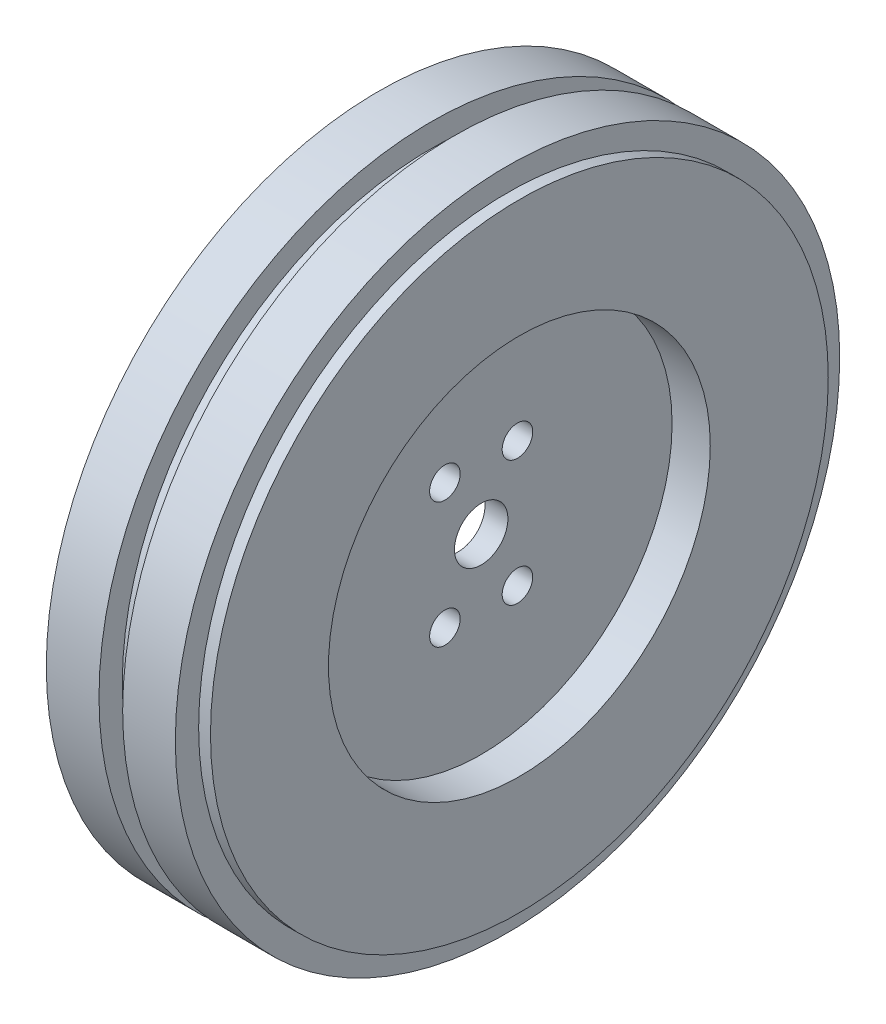
ISO-10303-21;
HEADER;
FILE_DESCRIPTION(('STEP AP214'),'2;1');
FILE_NAME('part.step','',(''),(''),'','','');
FILE_SCHEMA(('AUTOMOTIVE_DESIGN { 1 0 10303 214 1 1 1 1 }'));
ENDSEC;
DATA;
#1=APPLICATION_CONTEXT('core data for automotive mechanical design processes');
#2=APPLICATION_PROTOCOL_DEFINITION('international standard','automotive_design',2000,#1);
#3=PRODUCT_CONTEXT('',#1,'mechanical');
#4=PRODUCT('Part','Part','',(#3));
#5=PRODUCT_RELATED_PRODUCT_CATEGORY('part','',(#4));
#6=PRODUCT_DEFINITION_FORMATION('','',#4);
#7=PRODUCT_DEFINITION_CONTEXT('part definition',#1,'design');
#8=PRODUCT_DEFINITION('design','',#6,#7);
#9=PRODUCT_DEFINITION_SHAPE('','',#8);
#10=(LENGTH_UNIT() NAMED_UNIT(*) SI_UNIT(.MILLI.,.METRE.));
#11=(NAMED_UNIT(*) PLANE_ANGLE_UNIT() SI_UNIT($,.RADIAN.));
#12=(NAMED_UNIT(*) SI_UNIT($,.STERADIAN.) SOLID_ANGLE_UNIT());
#13=UNCERTAINTY_MEASURE_WITH_UNIT(LENGTH_MEASURE(1.E-05),#10,'distance_accuracy_value','');
#14=(GEOMETRIC_REPRESENTATION_CONTEXT(3) GLOBAL_UNCERTAINTY_ASSIGNED_CONTEXT((#13)) GLOBAL_UNIT_ASSIGNED_CONTEXT((#10,
#11,#12)) REPRESENTATION_CONTEXT('',''));
#15=CARTESIAN_POINT('',(0.,0.,0.));
#16=DIRECTION('',(0.,0.,1.));
#17=DIRECTION('',(1.,0.,0.));
#18=AXIS2_PLACEMENT_3D('',#15,#16,#17);
#19=CARTESIAN_POINT('',(8.00000000000001,0.,0.));
#20=DIRECTION('',(-1.,0.,0.));
#21=DIRECTION('',(0.,0.,1.));
#22=AXIS2_PLACEMENT_3D('',#19,#20,#21);
#23=CYLINDRICAL_SURFACE('',#22,43.5);
#24=CARTESIAN_POINT('',(-0.449999999999995,0.,0.));
#25=DIRECTION('',(-1.,0.,0.));
#26=DIRECTION('',(0.,0.,1.));
#27=AXIS2_PLACEMENT_3D('',#24,#25,#26);
#28=CIRCLE('',#27,43.5);
#29=CARTESIAN_POINT('',(-0.449999999999995,0.,43.5));
#30=VERTEX_POINT('',#29);
#31=EDGE_CURVE('E95',#30,#30,#28,.T.);
#32=ORIENTED_EDGE('',*,*,#31,.F.);
#33=EDGE_LOOP('',(#32));
#34=FACE_BOUND('',#33,.T.);
#35=CARTESIAN_POINT('',(6.45,0.,0.));
#36=DIRECTION('',(1.,0.,0.));
#37=DIRECTION('',(0.,0.,-1.));
#38=AXIS2_PLACEMENT_3D('',#35,#36,#37);
#39=CIRCLE('',#38,43.5);
#40=CARTESIAN_POINT('',(6.45,0.,-43.5));
#41=VERTEX_POINT('',#40);
#42=EDGE_CURVE('E101',#41,#41,#39,.T.);
#43=ORIENTED_EDGE('',*,*,#42,.F.);
#44=EDGE_LOOP('',(#43));
#45=FACE_BOUND('',#44,.T.);
#46=ADVANCED_FACE('F30',(#34,#45),#23,.T.);
#47=CARTESIAN_POINT('',(8.,40.,0.));
#48=DIRECTION('',(-1.,0.,0.));
#49=DIRECTION('',(0.,0.,1.));
#50=AXIS2_PLACEMENT_3D('',#47,#48,#49);
#51=PLANE('',#50);
#52=CARTESIAN_POINT('',(8.,0.,0.));
#53=DIRECTION('',(1.,0.,0.));
#54=DIRECTION('',(0.,0.,-1.));
#55=AXIS2_PLACEMENT_3D('',#52,#53,#54);
#56=CIRCLE('',#55,25.);
#57=CARTESIAN_POINT('',(8.,0.,-25.));
#58=VERTEX_POINT('',#57);
#59=EDGE_CURVE('E75',#58,#58,#56,.T.);
#60=ORIENTED_EDGE('',*,*,#59,.F.);
#61=EDGE_LOOP('',(#60));
#62=FACE_BOUND('',#61,.T.);
#63=CARTESIAN_POINT('',(8.,0.,0.));
#64=DIRECTION('',(1.,0.,0.));
#65=DIRECTION('',(0.,0.,-1.));
#66=AXIS2_PLACEMENT_3D('',#63,#64,#65);
#67=CIRCLE('',#66,40.45);
#68=CARTESIAN_POINT('',(8.,0.,-40.45));
#69=VERTEX_POINT('',#68);
#70=EDGE_CURVE('E105',#69,#69,#67,.T.);
#71=ORIENTED_EDGE('',*,*,#70,.T.);
#72=EDGE_LOOP('',(#71));
#73=FACE_BOUND('',#72,.T.);
#74=ADVANCED_FACE('F122',(#62,#73),#51,.F.);
#75=CARTESIAN_POINT('',(-12.,0.,0.));
#76=DIRECTION('',(-1.,0.,0.));
#77=DIRECTION('',(0.,0.,1.));
#78=AXIS2_PLACEMENT_3D('',#75,#76,#77);
#79=PLANE('',#78);
#80=CARTESIAN_POINT('',(-12.,0.,0.));
#81=DIRECTION('',(-1.,0.,0.));
#82=DIRECTION('',(0.,0.,1.));
#83=AXIS2_PLACEMENT_3D('',#80,#81,#82);
#84=CIRCLE('',#83,34.);
#85=CARTESIAN_POINT('',(-12.,0.,34.));
#86=VERTEX_POINT('',#85);
#87=EDGE_CURVE('E71',#86,#86,#84,.F.);
#88=ORIENTED_EDGE('',*,*,#87,.T.);
#89=EDGE_LOOP('',(#88));
#90=FACE_BOUND('',#89,.T.);
#91=CARTESIAN_POINT('',(-12.,0.,0.));
#92=DIRECTION('',(-1.,0.,0.));
#93=DIRECTION('',(0.,0.,1.));
#94=AXIS2_PLACEMENT_3D('',#91,#92,#93);
#95=CIRCLE('',#94,40.45);
#96=CARTESIAN_POINT('',(-12.,0.,40.45));
#97=VERTEX_POINT('',#96);
#98=EDGE_CURVE('E84',#97,#97,#95,.T.);
#99=ORIENTED_EDGE('',*,*,#98,.T.);
#100=EDGE_LOOP('',(#99));
#101=FACE_BOUND('',#100,.T.);
#102=ADVANCED_FACE('F129',(#90,#101),#79,.T.);
#103=CARTESIAN_POINT('',(-3.54999999999999,0.,0.));
#104=DIRECTION('',(-1.,0.,0.));
#105=DIRECTION('',(0.,0.,1.));
#106=AXIS2_PLACEMENT_3D('',#103,#104,#105);
#107=CIRCLE('',#106,43.5);
#108=CARTESIAN_POINT('',(-3.54999999999999,0.,43.5));
#109=VERTEX_POINT('',#108);
#110=EDGE_CURVE('E87',#109,#109,#107,.T.);
#111=ORIENTED_EDGE('',*,*,#110,.T.);
#112=EDGE_LOOP('',(#111));
#113=FACE_BOUND('',#112,.T.);
#114=CARTESIAN_POINT('',(-10.45,0.,0.));
#115=DIRECTION('',(-1.,0.,0.));
#116=DIRECTION('',(0.,0.,1.));
#117=AXIS2_PLACEMENT_3D('',#114,#115,#116);
#118=CIRCLE('',#117,43.5);
#119=CARTESIAN_POINT('',(-10.45,0.,43.5));
#120=VERTEX_POINT('',#119);
#121=EDGE_CURVE('E78',#120,#120,#118,.T.);
#122=ORIENTED_EDGE('',*,*,#121,.F.);
#123=EDGE_LOOP('',(#122));
#124=FACE_BOUND('',#123,.T.);
#125=ADVANCED_FACE('F125',(#113,#124),#23,.T.);
#126=CARTESIAN_POINT('',(-49.6444990272902,0.,0.));
#127=DIRECTION('',(-1.,0.,0.));
#128=DIRECTION('',(0.,0.,1.));
#129=AXIS2_PLACEMENT_3D('',#126,#127,#128);
#130=CYLINDRICAL_SURFACE('',#129,34.);
#131=CARTESIAN_POINT('',(0.,0.,0.));
#132=DIRECTION('',(-1.,0.,0.));
#133=DIRECTION('',(0.,0.,1.));
#134=AXIS2_PLACEMENT_3D('',#131,#132,#133);
#135=CIRCLE('',#134,34.);
#136=CARTESIAN_POINT('',(0.,0.,34.));
#137=VERTEX_POINT('',#136);
#138=EDGE_CURVE('E10',#137,#137,#135,.T.);
#139=ORIENTED_EDGE('',*,*,#138,.F.);
#140=EDGE_LOOP('',(#139));
#141=FACE_BOUND('',#140,.T.);
#142=ORIENTED_EDGE('',*,*,#87,.F.);
#143=EDGE_LOOP('',(#142));
#144=FACE_BOUND('',#143,.T.);
#145=ADVANCED_FACE('F32',(#141,#144),#130,.F.);
#146=CARTESIAN_POINT('',(0.,34.,0.));
#147=DIRECTION('',(1.,0.,0.));
#148=DIRECTION('',(0.,0.,-1.));
#149=AXIS2_PLACEMENT_3D('',#146,#147,#148);
#150=PLANE('',#149);
#151=CARTESIAN_POINT('',(0.,0.,0.));
#152=DIRECTION('',(1.,0.,0.));
#153=DIRECTION('',(0.,0.,-1.));
#154=AXIS2_PLACEMENT_3D('',#151,#152,#153);
#155=CIRCLE('',#154,3.5);
#156=CARTESIAN_POINT('',(0.,0.,-3.5));
#157=VERTEX_POINT('',#156);
#158=EDGE_CURVE('E65',#157,#157,#155,.T.);
#159=ORIENTED_EDGE('',*,*,#158,.T.);
#160=EDGE_LOOP('',(#159));
#161=FACE_BOUND('',#160,.T.);
#162=CARTESIAN_POINT('',(0.,8.22724133595216,4.75000000000001));
#163=DIRECTION('',(1.,0.,0.));
#164=DIRECTION('',(0.,0.,-1.));
#165=AXIS2_PLACEMENT_3D('',#162,#163,#164);
#166=CIRCLE('',#165,2.);
#167=CARTESIAN_POINT('',(0.,8.22724133595216,2.75000000000001));
#168=VERTEX_POINT('',#167);
#169=EDGE_CURVE('E37',#168,#168,#166,.T.);
#170=ORIENTED_EDGE('',*,*,#169,.T.);
#171=EDGE_LOOP('',(#170));
#172=FACE_BOUND('',#171,.T.);
#173=CARTESIAN_POINT('',(0.,-8.22724133595216,-4.75000000000001));
#174=DIRECTION('',(1.,0.,0.));
#175=DIRECTION('',(0.,0.,-1.));
#176=AXIS2_PLACEMENT_3D('',#173,#174,#175);
#177=CIRCLE('',#176,2.);
#178=CARTESIAN_POINT('',(0.,-8.22724133595216,-6.75000000000001));
#179=VERTEX_POINT('',#178);
#180=EDGE_CURVE('E41',#179,#179,#177,.T.);
#181=ORIENTED_EDGE('',*,*,#180,.T.);
#182=EDGE_LOOP('',(#181));
#183=FACE_BOUND('',#182,.T.);
#184=CARTESIAN_POINT('',(0.,-8.22724133595216,4.75000000000001));
#185=DIRECTION('',(1.,0.,0.));
#186=DIRECTION('',(0.,0.,-1.));
#187=AXIS2_PLACEMENT_3D('',#184,#185,#186);
#188=CIRCLE('',#187,2.);
#189=CARTESIAN_POINT('',(0.,-8.22724133595216,2.75000000000001));
#190=VERTEX_POINT('',#189);
#191=EDGE_CURVE('E45',#190,#190,#188,.T.);
#192=ORIENTED_EDGE('',*,*,#191,.T.);
#193=EDGE_LOOP('',(#192));
#194=FACE_BOUND('',#193,.T.);
#195=CARTESIAN_POINT('',(0.,8.22724133595216,-4.75000000000001));
#196=DIRECTION('',(1.,0.,0.));
#197=DIRECTION('',(0.,0.,-1.));
#198=AXIS2_PLACEMENT_3D('',#195,#196,#197);
#199=CIRCLE('',#198,2.);
#200=CARTESIAN_POINT('',(0.,8.22724133595216,-6.75000000000001));
#201=VERTEX_POINT('',#200);
#202=EDGE_CURVE('E50',#201,#201,#199,.T.);
#203=ORIENTED_EDGE('',*,*,#202,.T.);
#204=EDGE_LOOP('',(#203));
#205=FACE_BOUND('',#204,.T.);
#206=ORIENTED_EDGE('',*,*,#138,.T.);
#207=EDGE_LOOP('',(#206));
#208=FACE_BOUND('',#207,.T.);
#209=ADVANCED_FACE('F140',(#161,#172,#183,#194,#205,#208),#150,.F.);
#210=CARTESIAN_POINT('',(3.,12.5,0.));
#211=DIRECTION('',(1.,0.,0.));
#212=DIRECTION('',(0.,0.,-1.));
#213=AXIS2_PLACEMENT_3D('',#210,#211,#212);
#214=PLANE('',#213);
#215=CARTESIAN_POINT('',(3.,0.,0.));
#216=DIRECTION('',(1.,0.,0.));
#217=DIRECTION('',(0.,0.,-1.));
#218=AXIS2_PLACEMENT_3D('',#215,#216,#217);
#219=CIRCLE('',#218,3.5);
#220=CARTESIAN_POINT('',(3.,0.,-3.5));
#221=VERTEX_POINT('',#220);
#222=EDGE_CURVE('E68',#221,#221,#219,.T.);
#223=ORIENTED_EDGE('',*,*,#222,.F.);
#224=EDGE_LOOP('',(#223));
#225=FACE_BOUND('',#224,.T.);
#226=CARTESIAN_POINT('',(3.,8.22724133595216,4.75000000000001));
#227=DIRECTION('',(1.,0.,0.));
#228=DIRECTION('',(0.,0.,1.));
#229=AXIS2_PLACEMENT_3D('',#226,#227,#228);
#230=CIRCLE('',#229,2.);
#231=CARTESIAN_POINT('',(3.,8.22724133595216,6.75000000000001));
#232=VERTEX_POINT('',#231);
#233=EDGE_CURVE('E56',#232,#232,#230,.T.);
#234=ORIENTED_EDGE('',*,*,#233,.F.);
#235=EDGE_LOOP('',(#234));
#236=FACE_BOUND('',#235,.T.);
#237=CARTESIAN_POINT('',(3.,-8.22724133595216,-4.75000000000001));
#238=DIRECTION('',(1.,0.,0.));
#239=DIRECTION('',(0.,0.,1.));
#240=AXIS2_PLACEMENT_3D('',#237,#238,#239);
#241=CIRCLE('',#240,2.);
#242=CARTESIAN_POINT('',(3.,-8.22724133595216,-2.75000000000001));
#243=VERTEX_POINT('',#242);
#244=EDGE_CURVE('E57',#243,#243,#241,.T.);
#245=ORIENTED_EDGE('',*,*,#244,.F.);
#246=EDGE_LOOP('',(#245));
#247=FACE_BOUND('',#246,.T.);
#248=CARTESIAN_POINT('',(3.,-8.22724133595216,4.75000000000001));
#249=DIRECTION('',(1.,0.,0.));
#250=DIRECTION('',(0.,0.,-1.));
#251=AXIS2_PLACEMENT_3D('',#248,#249,#250);
#252=CIRCLE('',#251,2.);
#253=CARTESIAN_POINT('',(3.,-8.22724133595216,2.75000000000001));
#254=VERTEX_POINT('',#253);
#255=EDGE_CURVE('E60',#254,#254,#252,.T.);
#256=ORIENTED_EDGE('',*,*,#255,.F.);
#257=EDGE_LOOP('',(#256));
#258=FACE_BOUND('',#257,.T.);
#259=CARTESIAN_POINT('',(3.,8.22724133595216,-4.75000000000001));
#260=DIRECTION('',(1.,0.,0.));
#261=DIRECTION('',(0.,0.,-1.));
#262=AXIS2_PLACEMENT_3D('',#259,#260,#261);
#263=CIRCLE('',#262,2.);
#264=CARTESIAN_POINT('',(3.,8.22724133595216,-6.75000000000001));
#265=VERTEX_POINT('',#264);
#266=EDGE_CURVE('E53',#265,#265,#263,.T.);
#267=ORIENTED_EDGE('',*,*,#266,.F.);
#268=EDGE_LOOP('',(#267));
#269=FACE_BOUND('',#268,.T.);
#270=CARTESIAN_POINT('',(3.,0.,0.));
#271=DIRECTION('',(1.,0.,0.));
#272=DIRECTION('',(0.,0.,-1.));
#273=AXIS2_PLACEMENT_3D('',#270,#271,#272);
#274=CIRCLE('',#273,25.);
#275=CARTESIAN_POINT('',(3.,0.,-25.));
#276=VERTEX_POINT('',#275);
#277=EDGE_CURVE('E74',#276,#276,#274,.T.);
#278=ORIENTED_EDGE('',*,*,#277,.T.);
#279=EDGE_LOOP('',(#278));
#280=FACE_BOUND('',#279,.T.);
#281=ADVANCED_FACE('F231',(#225,#236,#247,#258,#269,#280),#214,.T.);
#282=CARTESIAN_POINT('',(-32.,8.22724133595216,-4.75000000000001));
#283=DIRECTION('',(1.,0.,0.));
#284=DIRECTION('',(0.,0.,-1.));
#285=AXIS2_PLACEMENT_3D('',#282,#283,#284);
#286=CYLINDRICAL_SURFACE('',#285,2.);
#287=ORIENTED_EDGE('',*,*,#266,.T.);
#288=EDGE_LOOP('',(#287));
#289=FACE_BOUND('',#288,.T.);
#290=ORIENTED_EDGE('',*,*,#202,.F.);
#291=EDGE_LOOP('',(#290));
#292=FACE_BOUND('',#291,.T.);
#293=ADVANCED_FACE('F235',(#289,#292),#286,.F.);
#294=CARTESIAN_POINT('',(-32.,-8.22724133595216,4.75000000000001));
#295=DIRECTION('',(1.,0.,0.));
#296=DIRECTION('',(0.,0.,-1.));
#297=AXIS2_PLACEMENT_3D('',#294,#295,#296);
#298=CYLINDRICAL_SURFACE('',#297,2.);
#299=ORIENTED_EDGE('',*,*,#255,.T.);
#300=EDGE_LOOP('',(#299));
#301=FACE_BOUND('',#300,.T.);
#302=ORIENTED_EDGE('',*,*,#191,.F.);
#303=EDGE_LOOP('',(#302));
#304=FACE_BOUND('',#303,.T.);
#305=ADVANCED_FACE('F281',(#301,#304),#298,.F.);
#306=CARTESIAN_POINT('',(-32.,-8.22724133595216,-4.75000000000001));
#307=DIRECTION('',(1.,0.,0.));
#308=DIRECTION('',(0.,0.,-1.));
#309=AXIS2_PLACEMENT_3D('',#306,#307,#308);
#310=CYLINDRICAL_SURFACE('',#309,2.);
#311=ORIENTED_EDGE('',*,*,#244,.T.);
#312=EDGE_LOOP('',(#311));
#313=FACE_BOUND('',#312,.T.);
#314=ORIENTED_EDGE('',*,*,#180,.F.);
#315=EDGE_LOOP('',(#314));
#316=FACE_BOUND('',#315,.T.);
#317=ADVANCED_FACE('F271',(#313,#316),#310,.F.);
#318=CARTESIAN_POINT('',(-32.,8.22724133595216,4.75000000000001));
#319=DIRECTION('',(1.,0.,0.));
#320=DIRECTION('',(0.,0.,-1.));
#321=AXIS2_PLACEMENT_3D('',#318,#319,#320);
#322=CYLINDRICAL_SURFACE('',#321,2.);
#323=ORIENTED_EDGE('',*,*,#233,.T.);
#324=EDGE_LOOP('',(#323));
#325=FACE_BOUND('',#324,.T.);
#326=ORIENTED_EDGE('',*,*,#169,.F.);
#327=EDGE_LOOP('',(#326));
#328=FACE_BOUND('',#327,.T.);
#329=ADVANCED_FACE('F253',(#325,#328),#322,.F.);
#330=CARTESIAN_POINT('',(-32.,0.,0.));
#331=DIRECTION('',(1.,0.,0.));
#332=DIRECTION('',(0.,0.,-1.));
#333=AXIS2_PLACEMENT_3D('',#330,#331,#332);
#334=CYLINDRICAL_SURFACE('',#333,3.5);
#335=ORIENTED_EDGE('',*,*,#222,.T.);
#336=EDGE_LOOP('',(#335));
#337=FACE_BOUND('',#336,.T.);
#338=ORIENTED_EDGE('',*,*,#158,.F.);
#339=EDGE_LOOP('',(#338));
#340=FACE_BOUND('',#339,.T.);
#341=ADVANCED_FACE('F160',(#337,#340),#334,.F.);
#342=CARTESIAN_POINT('',(3.,0.,0.));
#343=DIRECTION('',(1.,0.,0.));
#344=DIRECTION('',(0.,0.,-1.));
#345=AXIS2_PLACEMENT_3D('',#342,#343,#344);
#346=CYLINDRICAL_SURFACE('',#345,25.);
#347=ORIENTED_EDGE('',*,*,#277,.F.);
#348=EDGE_LOOP('',(#347));
#349=FACE_BOUND('',#348,.T.);
#350=ORIENTED_EDGE('',*,*,#59,.T.);
#351=EDGE_LOOP('',(#350));
#352=FACE_BOUND('',#351,.T.);
#353=ADVANCED_FACE('F151',(#349,#352),#346,.F.);
#354=CARTESIAN_POINT('',(-10.45,0.,0.));
#355=DIRECTION('',(-1.,0.,0.));
#356=DIRECTION('',(0.,0.,1.));
#357=AXIS2_PLACEMENT_3D('',#354,#355,#356);
#358=PLANE('',#357);
#359=CARTESIAN_POINT('',(-10.45,0.,0.));
#360=DIRECTION('',(-1.,0.,0.));
#361=DIRECTION('',(0.,0.,1.));
#362=AXIS2_PLACEMENT_3D('',#359,#360,#361);
#363=CIRCLE('',#362,40.45);
#364=CARTESIAN_POINT('',(-10.45,0.,40.45));
#365=VERTEX_POINT('',#364);
#366=EDGE_CURVE('E83',#365,#365,#363,.T.);
#367=ORIENTED_EDGE('',*,*,#366,.F.);
#368=EDGE_LOOP('',(#367));
#369=FACE_BOUND('',#368,.T.);
#370=ORIENTED_EDGE('',*,*,#121,.T.);
#371=EDGE_LOOP('',(#370));
#372=FACE_BOUND('',#371,.T.);
#373=ADVANCED_FACE('F148',(#369,#372),#358,.T.);
#374=CARTESIAN_POINT('',(-10.45,0.,0.));
#375=DIRECTION('',(-1.,0.,0.));
#376=DIRECTION('',(0.,0.,1.));
#377=AXIS2_PLACEMENT_3D('',#374,#375,#376);
#378=CYLINDRICAL_SURFACE('',#377,40.45);
#379=ORIENTED_EDGE('',*,*,#366,.T.);
#380=EDGE_LOOP('',(#379));
#381=FACE_BOUND('',#380,.T.);
#382=ORIENTED_EDGE('',*,*,#98,.F.);
#383=EDGE_LOOP('',(#382));
#384=FACE_BOUND('',#383,.T.);
#385=ADVANCED_FACE('F150',(#381,#384),#378,.T.);
#386=CARTESIAN_POINT('',(-3.54999999999999,0.,0.));
#387=DIRECTION('',(-1.,0.,0.));
#388=DIRECTION('',(0.,0.,1.));
#389=AXIS2_PLACEMENT_3D('',#386,#387,#388);
#390=PLANE('',#389);
#391=ORIENTED_EDGE('',*,*,#110,.F.);
#392=EDGE_LOOP('',(#391));
#393=FACE_BOUND('',#392,.T.);
#394=CARTESIAN_POINT('',(-3.54999999999999,0.,0.));
#395=DIRECTION('',(-1.,0.,0.));
#396=DIRECTION('',(0.,0.,1.));
#397=AXIS2_PLACEMENT_3D('',#394,#395,#396);
#398=CIRCLE('',#397,40.45);
#399=CARTESIAN_POINT('',(-3.54999999999999,0.,40.45));
#400=VERTEX_POINT('',#399);
#401=EDGE_CURVE('E92',#400,#400,#398,.T.);
#402=ORIENTED_EDGE('',*,*,#401,.T.);
#403=EDGE_LOOP('',(#402));
#404=FACE_BOUND('',#403,.T.);
#405=ADVANCED_FACE('F157',(#393,#404),#390,.F.);
#406=CARTESIAN_POINT('',(-3.54999999999999,0.,0.));
#407=DIRECTION('',(1.,0.,0.));
#408=DIRECTION('',(0.,0.,-1.));
#409=AXIS2_PLACEMENT_3D('',#406,#407,#408);
#410=CYLINDRICAL_SURFACE('',#409,40.45);
#411=ORIENTED_EDGE('',*,*,#401,.F.);
#412=EDGE_LOOP('',(#411));
#413=FACE_BOUND('',#412,.T.);
#414=CARTESIAN_POINT('',(-0.449999999999995,0.,0.));
#415=DIRECTION('',(-1.,0.,0.));
#416=DIRECTION('',(0.,0.,1.));
#417=AXIS2_PLACEMENT_3D('',#414,#415,#416);
#418=CIRCLE('',#417,40.45);
#419=CARTESIAN_POINT('',(-0.449999999999995,0.,40.45));
#420=VERTEX_POINT('',#419);
#421=EDGE_CURVE('E98',#420,#420,#418,.T.);
#422=ORIENTED_EDGE('',*,*,#421,.T.);
#423=EDGE_LOOP('',(#422));
#424=FACE_BOUND('',#423,.T.);
#425=ADVANCED_FACE('F166',(#413,#424),#410,.T.);
#426=CARTESIAN_POINT('',(-0.449999999999995,0.,0.));
#427=DIRECTION('',(-1.,0.,0.));
#428=DIRECTION('',(0.,0.,1.));
#429=AXIS2_PLACEMENT_3D('',#426,#427,#428);
#430=PLANE('',#429);
#431=ORIENTED_EDGE('',*,*,#421,.F.);
#432=EDGE_LOOP('',(#431));
#433=FACE_BOUND('',#432,.T.);
#434=ORIENTED_EDGE('',*,*,#31,.T.);
#435=EDGE_LOOP('',(#434));
#436=FACE_BOUND('',#435,.T.);
#437=ADVANCED_FACE('F117',(#433,#436),#430,.T.);
#438=CARTESIAN_POINT('',(6.45,0.,0.));
#439=DIRECTION('',(1.,0.,0.));
#440=DIRECTION('',(0.,0.,-1.));
#441=AXIS2_PLACEMENT_3D('',#438,#439,#440);
#442=PLANE('',#441);
#443=CARTESIAN_POINT('',(6.45,0.,0.));
#444=DIRECTION('',(1.,0.,0.));
#445=DIRECTION('',(0.,0.,-1.));
#446=AXIS2_PLACEMENT_3D('',#443,#444,#445);
#447=CIRCLE('',#446,40.45);
#448=CARTESIAN_POINT('',(6.45,0.,-40.45));
#449=VERTEX_POINT('',#448);
#450=EDGE_CURVE('E104',#449,#449,#447,.T.);
#451=ORIENTED_EDGE('',*,*,#450,.F.);
#452=EDGE_LOOP('',(#451));
#453=FACE_BOUND('',#452,.T.);
#454=ORIENTED_EDGE('',*,*,#42,.T.);
#455=EDGE_LOOP('',(#454));
#456=FACE_BOUND('',#455,.T.);
#457=ADVANCED_FACE('F114',(#453,#456),#442,.T.);
#458=CARTESIAN_POINT('',(6.45,0.,0.));
#459=DIRECTION('',(1.,0.,0.));
#460=DIRECTION('',(0.,0.,-1.));
#461=AXIS2_PLACEMENT_3D('',#458,#459,#460);
#462=CYLINDRICAL_SURFACE('',#461,40.45);
#463=ORIENTED_EDGE('',*,*,#450,.T.);
#464=EDGE_LOOP('',(#463));
#465=FACE_BOUND('',#464,.T.);
#466=ORIENTED_EDGE('',*,*,#70,.F.);
#467=EDGE_LOOP('',(#466));
#468=FACE_BOUND('',#467,.T.);
#469=ADVANCED_FACE('F111',(#465,#468),#462,.T.);
#470=CLOSED_SHELL('',(#46,#74,#102,#125,#145,#209,#281,#293,#305,#317,#329,#341,#353,#373,#385,
#405,#425,#437,#457,#469));
#471=MANIFOLD_SOLID_BREP('B2',#470);
#472=ADVANCED_BREP_SHAPE_REPRESENTATION('',(#18,#471),#14);
#473=SHAPE_DEFINITION_REPRESENTATION(#9,#472);
ENDSEC;
END-ISO-10303-21;
